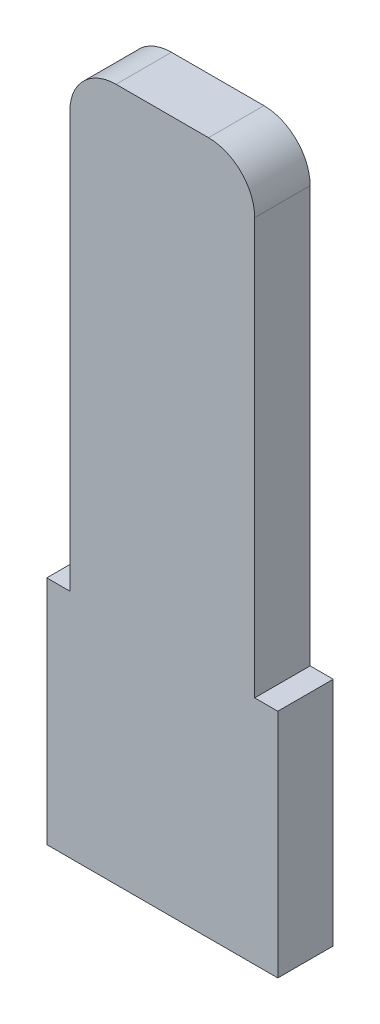
ISO-10303-21;
HEADER;
FILE_DESCRIPTION(('STEP AP214'),'2;1');
FILE_NAME('part.step','',(''),(''),'','','');
FILE_SCHEMA(('AUTOMOTIVE_DESIGN { 1 0 10303 214 1 1 1 1 }'));
ENDSEC;
DATA;
#1=APPLICATION_CONTEXT('core data for automotive mechanical design processes');
#2=APPLICATION_PROTOCOL_DEFINITION('international standard','automotive_design',2000,#1);
#3=PRODUCT_CONTEXT('',#1,'mechanical');
#4=PRODUCT('Part','Part','',(#3));
#5=PRODUCT_RELATED_PRODUCT_CATEGORY('part','',(#4));
#6=PRODUCT_DEFINITION_FORMATION('','',#4);
#7=PRODUCT_DEFINITION_CONTEXT('part definition',#1,'design');
#8=PRODUCT_DEFINITION('design','',#6,#7);
#9=PRODUCT_DEFINITION_SHAPE('','',#8);
#10=(LENGTH_UNIT() NAMED_UNIT(*) SI_UNIT(.MILLI.,.METRE.));
#11=(NAMED_UNIT(*) PLANE_ANGLE_UNIT() SI_UNIT($,.RADIAN.));
#12=(NAMED_UNIT(*) SI_UNIT($,.STERADIAN.) SOLID_ANGLE_UNIT());
#13=UNCERTAINTY_MEASURE_WITH_UNIT(LENGTH_MEASURE(1.E-05),#10,'distance_accuracy_value','');
#14=(GEOMETRIC_REPRESENTATION_CONTEXT(3) GLOBAL_UNCERTAINTY_ASSIGNED_CONTEXT((#13)) GLOBAL_UNIT_ASSIGNED_CONTEXT((#10,
#11,#12)) REPRESENTATION_CONTEXT('',''));
#15=CARTESIAN_POINT('',(0.,0.,0.));
#16=DIRECTION('',(0.,0.,1.));
#17=DIRECTION('',(1.,0.,0.));
#18=AXIS2_PLACEMENT_3D('',#15,#16,#17);
#19=CARTESIAN_POINT('',(2.5,2.5,0.6));
#20=DIRECTION('',(-1.,0.,0.));
#21=DIRECTION('',(0.,0.,1.));
#22=AXIS2_PLACEMENT_3D('',#19,#20,#21);
#23=PLANE('',#22);
#24=DIRECTION('',(0.,1.,0.));
#25=VECTOR('',#24,1.);
#26=CARTESIAN_POINT('',(2.5,2.5,-0.6));
#27=LINE('',#26,#25);
#28=CARTESIAN_POINT('',(2.5,-2.5,-0.6));
#29=VERTEX_POINT('',#28);
#30=CARTESIAN_POINT('',(2.5,2.5,-0.6));
#31=VERTEX_POINT('',#30);
#32=EDGE_CURVE('E138',#29,#31,#27,.T.);
#33=ORIENTED_EDGE('',*,*,#32,.T.);
#34=DIRECTION('',(0.,0.,-1.));
#35=VECTOR('',#34,1.);
#36=CARTESIAN_POINT('',(2.5,2.5,0.6));
#37=LINE('',#36,#35);
#38=CARTESIAN_POINT('',(2.5,2.5,0.6));
#39=VERTEX_POINT('',#38);
#40=EDGE_CURVE('E118',#39,#31,#37,.T.);
#41=ORIENTED_EDGE('',*,*,#40,.F.);
#42=DIRECTION('',(0.,1.,0.));
#43=VECTOR('',#42,1.);
#44=CARTESIAN_POINT('',(2.5,2.5,0.6));
#45=LINE('',#44,#43);
#46=CARTESIAN_POINT('',(2.5,-2.5,0.6));
#47=VERTEX_POINT('',#46);
#48=EDGE_CURVE('E126',#47,#39,#45,.T.);
#49=ORIENTED_EDGE('',*,*,#48,.F.);
#50=DIRECTION('',(0.,0.,-1.));
#51=VECTOR('',#50,1.);
#52=CARTESIAN_POINT('',(2.5,-2.5,0.6));
#53=LINE('',#52,#51);
#54=EDGE_CURVE('E180',#47,#29,#53,.T.);
#55=ORIENTED_EDGE('',*,*,#54,.T.);
#56=EDGE_LOOP('',(#33,#41,#49,#55));
#57=FACE_BOUND('',#56,.T.);
#58=ADVANCED_FACE('F37',(#57),#23,.F.);
#59=CARTESIAN_POINT('',(2.,2.5,0.6));
#60=DIRECTION('',(0.,-1.,0.));
#61=DIRECTION('',(0.,0.,-1.));
#62=AXIS2_PLACEMENT_3D('',#59,#60,#61);
#63=PLANE('',#62);
#64=DIRECTION('',(-1.,0.,0.));
#65=VECTOR('',#64,1.);
#66=CARTESIAN_POINT('',(2.,2.5,-0.6));
#67=LINE('',#66,#65);
#68=CARTESIAN_POINT('',(2.,2.5,-0.6));
#69=VERTEX_POINT('',#68);
#70=EDGE_CURVE('E202',#31,#69,#67,.T.);
#71=ORIENTED_EDGE('',*,*,#70,.T.);
#72=DIRECTION('',(0.,0.,-1.));
#73=VECTOR('',#72,1.);
#74=CARTESIAN_POINT('',(2.,2.5,0.6));
#75=LINE('',#74,#73);
#76=CARTESIAN_POINT('',(2.,2.5,0.6));
#77=VERTEX_POINT('',#76);
#78=EDGE_CURVE('E121',#77,#69,#75,.T.);
#79=ORIENTED_EDGE('',*,*,#78,.F.);
#80=DIRECTION('',(-1.,0.,0.));
#81=VECTOR('',#80,1.);
#82=CARTESIAN_POINT('',(2.,2.5,0.6));
#83=LINE('',#82,#81);
#84=EDGE_CURVE('E114',#39,#77,#83,.T.);
#85=ORIENTED_EDGE('',*,*,#84,.F.);
#86=ORIENTED_EDGE('',*,*,#40,.T.);
#87=EDGE_LOOP('',(#71,#79,#85,#86));
#88=FACE_BOUND('',#87,.T.);
#89=ADVANCED_FACE('F116',(#88),#63,.F.);
#90=CARTESIAN_POINT('',(2.,2.5,0.6));
#91=DIRECTION('',(-1.,0.,0.));
#92=DIRECTION('',(0.,0.,1.));
#93=AXIS2_PLACEMENT_3D('',#90,#91,#92);
#94=PLANE('',#93);
#95=DIRECTION('',(0.,1.,0.));
#96=VECTOR('',#95,1.);
#97=CARTESIAN_POINT('',(2.,2.5,-0.6));
#98=LINE('',#97,#96);
#99=CARTESIAN_POINT('',(2.,11.5,-0.6));
#100=VERTEX_POINT('',#99);
#101=EDGE_CURVE('E174',#69,#100,#98,.T.);
#102=ORIENTED_EDGE('',*,*,#101,.T.);
#103=DIRECTION('',(0.,0.,-1.));
#104=VECTOR('',#103,1.);
#105=CARTESIAN_POINT('',(2.,11.5,0.6));
#106=LINE('',#105,#104);
#107=CARTESIAN_POINT('',(2.,11.5,0.6));
#108=VERTEX_POINT('',#107);
#109=EDGE_CURVE('E149',#100,#108,#106,.F.);
#110=ORIENTED_EDGE('',*,*,#109,.T.);
#111=DIRECTION('',(0.,1.,0.));
#112=VECTOR('',#111,1.);
#113=CARTESIAN_POINT('',(2.,2.5,0.6));
#114=LINE('',#113,#112);
#115=EDGE_CURVE('E125',#77,#108,#114,.T.);
#116=ORIENTED_EDGE('',*,*,#115,.F.);
#117=ORIENTED_EDGE('',*,*,#78,.T.);
#118=EDGE_LOOP('',(#102,#110,#116,#117));
#119=FACE_BOUND('',#118,.T.);
#120=ADVANCED_FACE('F207',(#119),#94,.F.);
#121=CARTESIAN_POINT('',(-2.,12.5,0.6));
#122=DIRECTION('',(0.,-1.,0.));
#123=DIRECTION('',(0.,0.,-1.));
#124=AXIS2_PLACEMENT_3D('',#121,#122,#123);
#125=PLANE('',#124);
#126=DIRECTION('',(-1.,0.,0.));
#127=VECTOR('',#126,1.);
#128=CARTESIAN_POINT('',(-2.,12.5,-0.6));
#129=LINE('',#128,#127);
#130=CARTESIAN_POINT('',(0.999999999999998,12.5,-0.6));
#131=VERTEX_POINT('',#130);
#132=CARTESIAN_POINT('',(-1.,12.5,-0.6));
#133=VERTEX_POINT('',#132);
#134=EDGE_CURVE('E170',#131,#133,#129,.T.);
#135=ORIENTED_EDGE('',*,*,#134,.T.);
#136=DIRECTION('',(0.,0.,-1.));
#137=VECTOR('',#136,1.);
#138=CARTESIAN_POINT('',(-1.,12.5,0.6));
#139=LINE('',#138,#137);
#140=CARTESIAN_POINT('',(-1.,12.5,0.6));
#141=VERTEX_POINT('',#140);
#142=EDGE_CURVE('E45',#133,#141,#139,.F.);
#143=ORIENTED_EDGE('',*,*,#142,.T.);
#144=DIRECTION('',(-1.,0.,0.));
#145=VECTOR('',#144,1.);
#146=CARTESIAN_POINT('',(-2.,12.5,0.6));
#147=LINE('',#146,#145);
#148=CARTESIAN_POINT('',(0.999999999999998,12.5,0.6));
#149=VERTEX_POINT('',#148);
#150=EDGE_CURVE('E196',#149,#141,#147,.T.);
#151=ORIENTED_EDGE('',*,*,#150,.F.);
#152=DIRECTION('',(0.,0.,-1.));
#153=VECTOR('',#152,1.);
#154=CARTESIAN_POINT('',(0.999999999999998,12.5,0.6));
#155=LINE('',#154,#153);
#156=EDGE_CURVE('E139',#149,#131,#155,.T.);
#157=ORIENTED_EDGE('',*,*,#156,.T.);
#158=EDGE_LOOP('',(#135,#143,#151,#157));
#159=FACE_BOUND('',#158,.T.);
#160=ADVANCED_FACE('F212',(#159),#125,.F.);
#161=CARTESIAN_POINT('',(-2.,2.5,0.6));
#162=DIRECTION('',(1.,0.,0.));
#163=DIRECTION('',(0.,0.,-1.));
#164=AXIS2_PLACEMENT_3D('',#161,#162,#163);
#165=PLANE('',#164);
#166=DIRECTION('',(0.,-1.,0.));
#167=VECTOR('',#166,1.);
#168=CARTESIAN_POINT('',(-2.,2.5,0.6));
#169=LINE('',#168,#167);
#170=CARTESIAN_POINT('',(-2.,11.5,0.6));
#171=VERTEX_POINT('',#170);
#172=CARTESIAN_POINT('',(-2.,2.5,0.6));
#173=VERTEX_POINT('',#172);
#174=EDGE_CURVE('E163',#171,#173,#169,.T.);
#175=ORIENTED_EDGE('',*,*,#174,.F.);
#176=DIRECTION('',(0.,0.,-1.));
#177=VECTOR('',#176,1.);
#178=CARTESIAN_POINT('',(-2.,11.5,0.6));
#179=LINE('',#178,#177);
#180=CARTESIAN_POINT('',(-2.,11.5,-0.6));
#181=VERTEX_POINT('',#180);
#182=EDGE_CURVE('E153',#171,#181,#179,.T.);
#183=ORIENTED_EDGE('',*,*,#182,.T.);
#184=DIRECTION('',(0.,-1.,0.));
#185=VECTOR('',#184,1.);
#186=CARTESIAN_POINT('',(-2.,2.5,-0.6));
#187=LINE('',#186,#185);
#188=CARTESIAN_POINT('',(-2.,2.5,-0.6));
#189=VERTEX_POINT('',#188);
#190=EDGE_CURVE('E161',#181,#189,#187,.T.);
#191=ORIENTED_EDGE('',*,*,#190,.T.);
#192=DIRECTION('',(0.,0.,-1.));
#193=VECTOR('',#192,1.);
#194=CARTESIAN_POINT('',(-2.,2.5,0.6));
#195=LINE('',#194,#193);
#196=EDGE_CURVE('E144',#173,#189,#195,.T.);
#197=ORIENTED_EDGE('',*,*,#196,.F.);
#198=EDGE_LOOP('',(#175,#183,#191,#197));
#199=FACE_BOUND('',#198,.T.);
#200=ADVANCED_FACE('F159',(#199),#165,.F.);
#201=CARTESIAN_POINT('',(-2.5,2.5,0.6));
#202=DIRECTION('',(0.,-1.,0.));
#203=DIRECTION('',(0.,0.,-1.));
#204=AXIS2_PLACEMENT_3D('',#201,#202,#203);
#205=PLANE('',#204);
#206=DIRECTION('',(-1.,0.,0.));
#207=VECTOR('',#206,1.);
#208=CARTESIAN_POINT('',(-2.5,2.5,-0.6));
#209=LINE('',#208,#207);
#210=CARTESIAN_POINT('',(-2.5,2.5,-0.6));
#211=VERTEX_POINT('',#210);
#212=EDGE_CURVE('E169',#189,#211,#209,.T.);
#213=ORIENTED_EDGE('',*,*,#212,.T.);
#214=DIRECTION('',(0.,0.,-1.));
#215=VECTOR('',#214,1.);
#216=CARTESIAN_POINT('',(-2.5,2.5,0.6));
#217=LINE('',#216,#215);
#218=CARTESIAN_POINT('',(-2.5,2.5,0.6));
#219=VERTEX_POINT('',#218);
#220=EDGE_CURVE('E185',#219,#211,#217,.T.);
#221=ORIENTED_EDGE('',*,*,#220,.F.);
#222=DIRECTION('',(-1.,0.,0.));
#223=VECTOR('',#222,1.);
#224=CARTESIAN_POINT('',(-2.5,2.5,0.6));
#225=LINE('',#224,#223);
#226=EDGE_CURVE('E191',#173,#219,#225,.T.);
#227=ORIENTED_EDGE('',*,*,#226,.F.);
#228=ORIENTED_EDGE('',*,*,#196,.T.);
#229=EDGE_LOOP('',(#213,#221,#227,#228));
#230=FACE_BOUND('',#229,.T.);
#231=ADVANCED_FACE('F189',(#230),#205,.F.);
#232=CARTESIAN_POINT('',(-2.5,2.5,0.6));
#233=DIRECTION('',(1.,0.,0.));
#234=DIRECTION('',(0.,0.,-1.));
#235=AXIS2_PLACEMENT_3D('',#232,#233,#234);
#236=PLANE('',#235);
#237=DIRECTION('',(0.,-1.,0.));
#238=VECTOR('',#237,1.);
#239=CARTESIAN_POINT('',(-2.5,2.5,-0.6));
#240=LINE('',#239,#238);
#241=CARTESIAN_POINT('',(-2.5,-2.5,-0.6));
#242=VERTEX_POINT('',#241);
#243=EDGE_CURVE('E172',#211,#242,#240,.T.);
#244=ORIENTED_EDGE('',*,*,#243,.T.);
#245=DIRECTION('',(0.,0.,-1.));
#246=VECTOR('',#245,1.);
#247=CARTESIAN_POINT('',(-2.5,-2.5,0.6));
#248=LINE('',#247,#246);
#249=CARTESIAN_POINT('',(-2.5,-2.5,0.6));
#250=VERTEX_POINT('',#249);
#251=EDGE_CURVE('E182',#250,#242,#248,.T.);
#252=ORIENTED_EDGE('',*,*,#251,.F.);
#253=DIRECTION('',(0.,-1.,0.));
#254=VECTOR('',#253,1.);
#255=CARTESIAN_POINT('',(-2.5,2.5,0.6));
#256=LINE('',#255,#254);
#257=EDGE_CURVE('E193',#219,#250,#256,.T.);
#258=ORIENTED_EDGE('',*,*,#257,.F.);
#259=ORIENTED_EDGE('',*,*,#220,.T.);
#260=EDGE_LOOP('',(#244,#252,#258,#259));
#261=FACE_BOUND('',#260,.T.);
#262=ADVANCED_FACE('F233',(#261),#236,.F.);
#263=CARTESIAN_POINT('',(-2.5,-2.5,0.6));
#264=DIRECTION('',(0.,1.,0.));
#265=DIRECTION('',(0.,0.,1.));
#266=AXIS2_PLACEMENT_3D('',#263,#264,#265);
#267=PLANE('',#266);
#268=DIRECTION('',(1.,0.,0.));
#269=VECTOR('',#268,1.);
#270=CARTESIAN_POINT('',(-2.5,-2.5,-0.6));
#271=LINE('',#270,#269);
#272=EDGE_CURVE('E135',#242,#29,#271,.T.);
#273=ORIENTED_EDGE('',*,*,#272,.T.);
#274=ORIENTED_EDGE('',*,*,#54,.F.);
#275=DIRECTION('',(1.,0.,0.));
#276=VECTOR('',#275,1.);
#277=CARTESIAN_POINT('',(-2.5,-2.5,0.6));
#278=LINE('',#277,#276);
#279=EDGE_CURVE('E131',#250,#47,#278,.T.);
#280=ORIENTED_EDGE('',*,*,#279,.F.);
#281=ORIENTED_EDGE('',*,*,#251,.T.);
#282=EDGE_LOOP('',(#273,#274,#280,#281));
#283=FACE_BOUND('',#282,.T.);
#284=ADVANCED_FACE('F236',(#283),#267,.F.);
#285=CARTESIAN_POINT('',(0.,0.,0.6));
#286=DIRECTION('',(0.,0.,1.));
#287=DIRECTION('',(1.,0.,0.));
#288=AXIS2_PLACEMENT_3D('',#285,#286,#287);
#289=PLANE('',#288);
#290=ORIENTED_EDGE('',*,*,#150,.T.);
#291=CARTESIAN_POINT('',(-1.,11.5,0.6));
#292=DIRECTION('',(0.,0.,1.));
#293=DIRECTION('',(1.,0.,0.));
#294=AXIS2_PLACEMENT_3D('',#291,#292,#293);
#295=CIRCLE('',#294,1.);
#296=EDGE_CURVE('E11',#141,#171,#295,.T.);
#297=ORIENTED_EDGE('',*,*,#296,.T.);
#298=ORIENTED_EDGE('',*,*,#174,.T.);
#299=ORIENTED_EDGE('',*,*,#226,.T.);
#300=ORIENTED_EDGE('',*,*,#257,.T.);
#301=ORIENTED_EDGE('',*,*,#279,.T.);
#302=ORIENTED_EDGE('',*,*,#48,.T.);
#303=ORIENTED_EDGE('',*,*,#84,.T.);
#304=ORIENTED_EDGE('',*,*,#115,.T.);
#305=CARTESIAN_POINT('',(0.999999999999998,11.5,0.6));
#306=DIRECTION('',(0.,0.,1.));
#307=DIRECTION('',(1.,0.,0.));
#308=AXIS2_PLACEMENT_3D('',#305,#306,#307);
#309=CIRCLE('',#308,1.);
#310=EDGE_CURVE('E151',#108,#149,#309,.T.);
#311=ORIENTED_EDGE('',*,*,#310,.T.);
#312=EDGE_LOOP('',(#290,#297,#298,#299,#300,#301,#302,#303,#304,#311));
#313=FACE_BOUND('',#312,.T.);
#314=ADVANCED_FACE('F129',(#313),#289,.T.);
#315=CARTESIAN_POINT('',(0.,0.,-0.6));
#316=DIRECTION('',(0.,0.,1.));
#317=DIRECTION('',(1.,0.,0.));
#318=AXIS2_PLACEMENT_3D('',#315,#316,#317);
#319=PLANE('',#318);
#320=ORIENTED_EDGE('',*,*,#190,.F.);
#321=CARTESIAN_POINT('',(-1.,11.5,-0.6));
#322=DIRECTION('',(0.,0.,1.));
#323=DIRECTION('',(1.,0.,0.));
#324=AXIS2_PLACEMENT_3D('',#321,#322,#323);
#325=CIRCLE('',#324,1.);
#326=EDGE_CURVE('E59',#181,#133,#325,.F.);
#327=ORIENTED_EDGE('',*,*,#326,.T.);
#328=ORIENTED_EDGE('',*,*,#134,.F.);
#329=CARTESIAN_POINT('',(0.999999999999998,11.5,-0.6));
#330=DIRECTION('',(0.,0.,1.));
#331=DIRECTION('',(1.,0.,0.));
#332=AXIS2_PLACEMENT_3D('',#329,#330,#331);
#333=CIRCLE('',#332,1.);
#334=EDGE_CURVE('E142',#131,#100,#333,.F.);
#335=ORIENTED_EDGE('',*,*,#334,.T.);
#336=ORIENTED_EDGE('',*,*,#101,.F.);
#337=ORIENTED_EDGE('',*,*,#70,.F.);
#338=ORIENTED_EDGE('',*,*,#32,.F.);
#339=ORIENTED_EDGE('',*,*,#272,.F.);
#340=ORIENTED_EDGE('',*,*,#243,.F.);
#341=ORIENTED_EDGE('',*,*,#212,.F.);
#342=EDGE_LOOP('',(#320,#327,#328,#335,#336,#337,#338,#339,#340,#341));
#343=FACE_BOUND('',#342,.T.);
#344=ADVANCED_FACE('F167',(#343),#319,.F.);
#345=CARTESIAN_POINT('',(0.999999999999998,11.5,0.6));
#346=DIRECTION('',(0.,0.,-1.));
#347=DIRECTION('',(-1.,0.,0.));
#348=AXIS2_PLACEMENT_3D('',#345,#346,#347);
#349=CYLINDRICAL_SURFACE('',#348,1.);
#350=ORIENTED_EDGE('',*,*,#310,.F.);
#351=ORIENTED_EDGE('',*,*,#109,.F.);
#352=ORIENTED_EDGE('',*,*,#334,.F.);
#353=ORIENTED_EDGE('',*,*,#156,.F.);
#354=EDGE_LOOP('',(#350,#351,#352,#353));
#355=FACE_BOUND('',#354,.T.);
#356=ADVANCED_FACE('F210',(#355),#349,.T.);
#357=CARTESIAN_POINT('',(-1.,11.5,0.6));
#358=DIRECTION('',(0.,0.,-1.));
#359=DIRECTION('',(-1.,0.,0.));
#360=AXIS2_PLACEMENT_3D('',#357,#358,#359);
#361=CYLINDRICAL_SURFACE('',#360,1.);
#362=ORIENTED_EDGE('',*,*,#296,.F.);
#363=ORIENTED_EDGE('',*,*,#142,.F.);
#364=ORIENTED_EDGE('',*,*,#326,.F.);
#365=ORIENTED_EDGE('',*,*,#182,.F.);
#366=EDGE_LOOP('',(#362,#363,#364,#365));
#367=FACE_BOUND('',#366,.T.);
#368=ADVANCED_FACE('F39',(#367),#361,.T.);
#369=CLOSED_SHELL('',(#58,#89,#120,#160,#200,#231,#262,#284,#314,#344,#356,#368));
#370=MANIFOLD_SOLID_BREP('B2',#369);
#371=ADVANCED_BREP_SHAPE_REPRESENTATION('',(#18,#370),#14);
#372=SHAPE_DEFINITION_REPRESENTATION(#9,#371);
ENDSEC;
END-ISO-10303-21;
